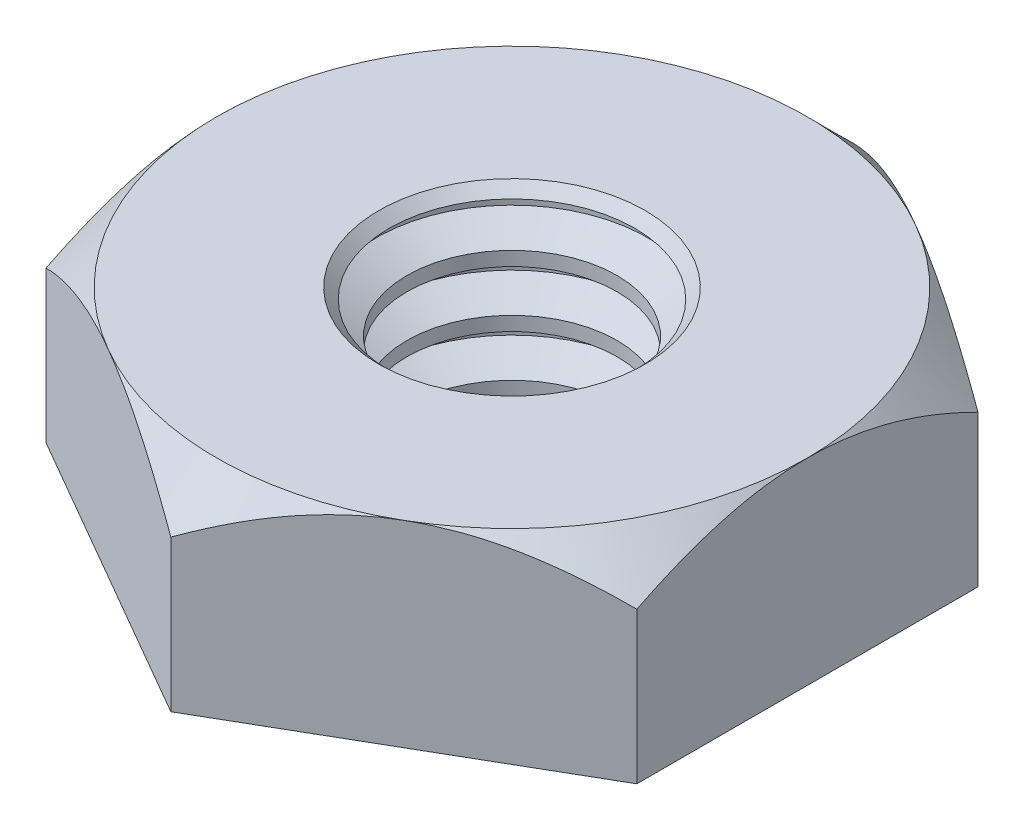
ISO-10303-21;
HEADER;
FILE_DESCRIPTION(('STEP AP214'),'2;1');
FILE_NAME('part.step','',(''),(''),'','','');
FILE_SCHEMA(('AUTOMOTIVE_DESIGN { 1 0 10303 214 1 1 1 1 }'));
ENDSEC;
DATA;
#1=APPLICATION_CONTEXT('core data for automotive mechanical design processes');
#2=APPLICATION_PROTOCOL_DEFINITION('international standard','automotive_design',2000,#1);
#3=PRODUCT_CONTEXT('',#1,'mechanical');
#4=PRODUCT('Part','Part','',(#3));
#5=PRODUCT_RELATED_PRODUCT_CATEGORY('part','',(#4));
#6=PRODUCT_DEFINITION_FORMATION('','',#4);
#7=PRODUCT_DEFINITION_CONTEXT('part definition',#1,'design');
#8=PRODUCT_DEFINITION('design','',#6,#7);
#9=PRODUCT_DEFINITION_SHAPE('','',#8);
#10=(LENGTH_UNIT() NAMED_UNIT(*) SI_UNIT(.MILLI.,.METRE.));
#11=(NAMED_UNIT(*) PLANE_ANGLE_UNIT() SI_UNIT($,.RADIAN.));
#12=(NAMED_UNIT(*) SI_UNIT($,.STERADIAN.) SOLID_ANGLE_UNIT());
#13=UNCERTAINTY_MEASURE_WITH_UNIT(LENGTH_MEASURE(1.E-05),#10,'distance_accuracy_value','');
#14=(GEOMETRIC_REPRESENTATION_CONTEXT(3) GLOBAL_UNCERTAINTY_ASSIGNED_CONTEXT((#13)) GLOBAL_UNIT_ASSIGNED_CONTEXT((#10,
#11,#12)) REPRESENTATION_CONTEXT('',''));
#15=CARTESIAN_POINT('',(0.,0.,0.));
#16=DIRECTION('',(0.,0.,1.));
#17=DIRECTION('',(1.,0.,0.));
#18=AXIS2_PLACEMENT_3D('',#15,#16,#17);
#19=CARTESIAN_POINT('',(0.,0.,-2.7496306570156));
#20=DIRECTION('',(0.,1.,0.));
#21=DIRECTION('',(0.,0.,1.));
#22=AXIS2_PLACEMENT_3D('',#19,#20,#21);
#23=PLANE('',#22);
#24=DIRECTION('',(-0.866025403784439,0.,-0.5));
#25=VECTOR('',#24,1.);
#26=CARTESIAN_POINT('',(2.38125,0.,-1.37481532850781));
#27=LINE('',#26,#25);
#28=CARTESIAN_POINT('',(2.38125,0.,-1.37481532850781));
#29=VERTEX_POINT('',#28);
#30=CARTESIAN_POINT('',(0.,0.,-2.7496306570156));
#31=VERTEX_POINT('',#30);
#32=EDGE_CURVE('E239',#29,#31,#27,.T.);
#33=ORIENTED_EDGE('',*,*,#32,.F.);
#34=DIRECTION('',(0.,0.,-1.));
#35=VECTOR('',#34,1.);
#36=CARTESIAN_POINT('',(2.38125,0.,1.37481532850779));
#37=LINE('',#36,#35);
#38=CARTESIAN_POINT('',(2.38125,0.,1.37481532850779));
#39=VERTEX_POINT('',#38);
#40=EDGE_CURVE('E328',#39,#29,#37,.T.);
#41=ORIENTED_EDGE('',*,*,#40,.F.);
#42=DIRECTION('',(0.866025403784439,0.,-0.5));
#43=VECTOR('',#42,1.);
#44=CARTESIAN_POINT('',(0.,0.,2.74963065701559));
#45=LINE('',#44,#43);
#46=CARTESIAN_POINT('',(0.,0.,2.74963065701559));
#47=VERTEX_POINT('',#46);
#48=EDGE_CURVE('E327',#47,#39,#45,.T.);
#49=ORIENTED_EDGE('',*,*,#48,.F.);
#50=DIRECTION('',(0.866025403784439,0.,0.5));
#51=VECTOR('',#50,1.);
#52=CARTESIAN_POINT('',(-2.38125,0.,1.37481532850779));
#53=LINE('',#52,#51);
#54=CARTESIAN_POINT('',(-2.38125,0.,1.37481532850779));
#55=VERTEX_POINT('',#54);
#56=EDGE_CURVE('E126',#55,#47,#53,.T.);
#57=ORIENTED_EDGE('',*,*,#56,.F.);
#58=DIRECTION('',(0.,0.,1.));
#59=VECTOR('',#58,1.);
#60=CARTESIAN_POINT('',(-2.38125,0.,-1.3748153285078));
#61=LINE('',#60,#59);
#62=CARTESIAN_POINT('',(-2.38125,0.,-1.3748153285078));
#63=VERTEX_POINT('',#62);
#64=EDGE_CURVE('E333',#63,#55,#61,.T.);
#65=ORIENTED_EDGE('',*,*,#64,.F.);
#66=DIRECTION('',(-0.866025403784438,0.,0.500000000000001));
#67=VECTOR('',#66,1.);
#68=CARTESIAN_POINT('',(0.,0.,-2.7496306570156));
#69=LINE('',#68,#67);
#70=EDGE_CURVE('E336',#31,#63,#69,.T.);
#71=ORIENTED_EDGE('',*,*,#70,.F.);
#72=EDGE_LOOP('',(#33,#41,#49,#57,#65,#71));
#73=FACE_BOUND('',#72,.T.);
#74=CARTESIAN_POINT('',(0.,0.,0.));
#75=DIRECTION('',(0.,1.,0.));
#76=DIRECTION('',(0.,0.,1.));
#77=AXIS2_PLACEMENT_3D('',#74,#75,#76);
#78=CIRCLE('',#77,1.04309945255329);
#79=CARTESIAN_POINT('',(0.,0.,1.04309945255329));
#80=VERTEX_POINT('',#79);
#81=EDGE_CURVE('E143',#80,#80,#78,.F.);
#82=ORIENTED_EDGE('',*,*,#81,.F.);
#83=EDGE_LOOP('',(#82));
#84=FACE_BOUND('',#83,.T.);
#85=ADVANCED_FACE('F32',(#73,#84),#23,.F.);
#86=CARTESIAN_POINT('',(0.,1.5875,-2.7496306570156));
#87=DIRECTION('',(0.,1.,0.));
#88=DIRECTION('',(0.,0.,1.));
#89=AXIS2_PLACEMENT_3D('',#86,#87,#88);
#90=PLANE('',#89);
#91=CARTESIAN_POINT('',(0.,1.5875,0.));
#92=DIRECTION('',(0.,1.,0.));
#93=DIRECTION('',(0.,0.,1.));
#94=AXIS2_PLACEMENT_3D('',#91,#92,#93);
#95=CIRCLE('',#94,1.07348297705218);
#96=CARTESIAN_POINT('',(0.,1.5875,1.07348297705218));
#97=VERTEX_POINT('',#96);
#98=EDGE_CURVE('E11',#97,#97,#95,.F.);
#99=ORIENTED_EDGE('',*,*,#98,.T.);
#100=EDGE_LOOP('',(#99));
#101=FACE_BOUND('',#100,.T.);
#102=CARTESIAN_POINT('',(0.,1.5875,0.));
#103=DIRECTION('',(0.,1.,0.));
#104=DIRECTION('',(0.,0.,1.));
#105=AXIS2_PLACEMENT_3D('',#102,#103,#104);
#106=CIRCLE('',#105,2.38125);
#107=CARTESIAN_POINT('',(-1.190625,1.5875,2.06222299276169));
#108=VERTEX_POINT('',#107);
#109=CARTESIAN_POINT('',(1.190625,1.5875,2.06222299276169));
#110=VERTEX_POINT('',#109);
#111=EDGE_CURVE('E108',#108,#110,#106,.T.);
#112=ORIENTED_EDGE('',*,*,#111,.T.);
#113=CARTESIAN_POINT('',(0.,1.5875,0.));
#114=DIRECTION('',(0.,1.,0.));
#115=DIRECTION('',(0.,0.,1.));
#116=AXIS2_PLACEMENT_3D('',#113,#114,#115);
#117=CIRCLE('',#116,2.38125);
#118=CARTESIAN_POINT('',(2.38125,1.5875,0.));
#119=VERTEX_POINT('',#118);
#120=EDGE_CURVE('E48',#110,#119,#117,.T.);
#121=ORIENTED_EDGE('',*,*,#120,.T.);
#122=CARTESIAN_POINT('',(1.190625,1.5875,-2.06222299276169));
#123=VERTEX_POINT('',#122);
#124=EDGE_CURVE('E142',#119,#123,#106,.T.);
#125=ORIENTED_EDGE('',*,*,#124,.T.);
#126=CARTESIAN_POINT('',(-1.190625,1.5875,-2.06222299276169));
#127=VERTEX_POINT('',#126);
#128=EDGE_CURVE('E150',#123,#127,#106,.T.);
#129=ORIENTED_EDGE('',*,*,#128,.T.);
#130=CARTESIAN_POINT('',(-2.38125,1.5875,0.));
#131=VERTEX_POINT('',#130);
#132=EDGE_CURVE('E153',#127,#131,#106,.T.);
#133=ORIENTED_EDGE('',*,*,#132,.T.);
#134=EDGE_CURVE('E141',#131,#108,#106,.T.);
#135=ORIENTED_EDGE('',*,*,#134,.T.);
#136=EDGE_LOOP('',(#112,#121,#125,#129,#133,#135));
#137=FACE_BOUND('',#136,.T.);
#138=ADVANCED_FACE('F160',(#101,#137),#90,.T.);
#139=CARTESIAN_POINT('',(2.38125,1.5875,-1.37481532850781));
#140=DIRECTION('',(-0.5,0.,0.866025403784439));
#141=DIRECTION('',(0.866025403784439,0.,0.5));
#142=AXIS2_PLACEMENT_3D('',#139,#140,#141);
#143=PLANE('',#142);
#144=CARTESIAN_POINT('',(2.38145,1.21900386565717,-1.37469985845397));
#145=CARTESIAN_POINT('',(2.29959321762095,1.26622444627487,-1.42195989379551));
#146=CARTESIAN_POINT('',(2.21636766622824,1.31067176769151,-1.47001018829555));
#147=CARTESIAN_POINT('',(2.04666151916196,1.39205388599882,-1.5679900779874));
#148=CARTESIAN_POINT('',(1.96016478264689,1.42894339988927,-1.61792899209839));
#149=CARTESIAN_POINT('',(1.78574822599095,1.4921359298185,-1.71862843803483));
#150=CARTESIAN_POINT('',(1.69787282881932,1.51859778425492,-1.76936332224702));
#151=CARTESIAN_POINT('',(1.52018740592912,1.55936782736834,-1.87195004898375));
#152=CARTESIAN_POINT('',(1.43038280881412,1.57370645145385,-1.92379875730256));
#153=CARTESIAN_POINT('',(1.27561039686965,1.58664355821429,-2.01315665100182));
#154=CARTESIAN_POINT('',(1.21084255103038,1.58855873833122,-2.05055038423196));
#155=CARTESIAN_POINT('',(1.08141272066442,1.58533272021672,-2.12527673163492));
#156=CARTESIAN_POINT('',(1.01675078120663,1.58018904812731,-2.16260931978719));
#157=CARTESIAN_POINT('',(0.888037451422591,1.56313803211276,-2.2369219953863));
#158=CARTESIAN_POINT('',(0.823986825765133,1.55122312163506,-2.2739016413514));
#159=CARTESIAN_POINT('',(0.696993161094712,1.52128367063236,-2.34722146783424));
#160=CARTESIAN_POINT('',(0.63405003756416,1.50325959846594,-2.38356169714824));
#161=CARTESIAN_POINT('',(0.472823849267805,1.44975053543199,-2.47664568036156));
#162=CARTESIAN_POINT('',(0.37554050871215,1.41023192211222,-2.53281224321903));
#163=CARTESIAN_POINT('',(0.232493937374424,1.3435189994336,-2.61540021968752));
#164=CARTESIAN_POINT('',(0.185353711056031,1.32007913387306,-2.64261664204211));
#165=CARTESIAN_POINT('',(0.0919464736333594,1.27106266632487,-2.69654533571235));
#166=CARTESIAN_POINT('',(0.0456789475031774,1.24548737621755,-2.72325790437834));
#167=CARTESIAN_POINT('',(-0.000199999999999734,1.21900386565717,-2.74974612706944));
#168=B_SPLINE_CURVE_WITH_KNOTS('',3,(#144,#145,#146,#147,#148,#149,#150,#151,#152,#153,#154,
#155,#156,#157,#158,#159,#160,#161,#162,#163,#164,#165,#166,#167),.UNSPECIFIED.,.F.,.F.,(4,2,2,
2,2,2,2,2,2,2,2,4),(0.,0.317196610611949,0.636241461041219,0.950218950629223,1.26340583824126,
1.48752413747844,1.71172100167748,1.93616888974083,2.16059957440838,2.51709639744763,
2.69486147369099,2.87251813383153),.UNSPECIFIED.);
#169=CARTESIAN_POINT('',(2.38125,1.2191193429844,-1.37481532850782));
#170=VERTEX_POINT('',#169);
#171=EDGE_CURVE('E338',#170,#123,#168,.T.);
#172=ORIENTED_EDGE('',*,*,#171,.F.);
#173=DIRECTION('',(0.,-1.,0.));
#174=VECTOR('',#173,1.);
#175=CARTESIAN_POINT('',(2.38125,1.5875,-1.37481532850781));
#176=LINE('',#175,#174);
#177=EDGE_CURVE('E133',#170,#29,#176,.T.);
#178=ORIENTED_EDGE('',*,*,#177,.T.);
#179=ORIENTED_EDGE('',*,*,#32,.T.);
#180=DIRECTION('',(0.,-1.,0.));
#181=VECTOR('',#180,1.);
#182=CARTESIAN_POINT('',(0.,1.5875,-2.7496306570156));
#183=LINE('',#182,#181);
#184=CARTESIAN_POINT('',(0.,1.2191193429844,-2.7496306570156));
#185=VERTEX_POINT('',#184);
#186=EDGE_CURVE('E138',#185,#31,#183,.T.);
#187=ORIENTED_EDGE('',*,*,#186,.F.);
#188=EDGE_CURVE('E211',#123,#185,#168,.T.);
#189=ORIENTED_EDGE('',*,*,#188,.F.);
#190=EDGE_LOOP('',(#172,#178,#179,#187,#189));
#191=FACE_BOUND('',#190,.T.);
#192=ADVANCED_FACE('F34',(#191),#143,.F.);
#193=CARTESIAN_POINT('',(0.,1.5875,-2.7496306570156));
#194=DIRECTION('',(0.500000000000001,0.,0.866025403784438));
#195=DIRECTION('',(0.866025403784438,0.,-0.500000000000001));
#196=AXIS2_PLACEMENT_3D('',#193,#194,#195);
#197=PLANE('',#196);
#198=CARTESIAN_POINT('',(0.000200000000000166,1.21900386565717,-2.74974612706944));
#199=CARTESIAN_POINT('',(-0.0816567823790508,1.26622444627487,-2.7024860917279));
#200=CARTESIAN_POINT('',(-0.164882333771762,1.31067176769151,-2.65443579722786));
#201=CARTESIAN_POINT('',(-0.334588480838043,1.39205388599882,-2.55645590753601));
#202=CARTESIAN_POINT('',(-0.421085217353107,1.42894339988927,-2.50651699342501));
#203=CARTESIAN_POINT('',(-0.595501774009049,1.49213592981849,-2.40581754748858));
#204=CARTESIAN_POINT('',(-0.683377171180682,1.51859778425492,-2.35508266327639));
#205=CARTESIAN_POINT('',(-0.861062594070885,1.55936782736834,-2.25249593653966));
#206=CARTESIAN_POINT('',(-0.950867191185882,1.57370645145385,-2.20064722822085));
#207=CARTESIAN_POINT('',(-1.10563960313035,1.58664355821429,-2.11128933452158));
#208=CARTESIAN_POINT('',(-1.17040744896963,1.58855873833122,-2.07389560129144));
#209=CARTESIAN_POINT('',(-1.29983727933559,1.58533272021672,-1.99916925388849));
#210=CARTESIAN_POINT('',(-1.36449921879337,1.58018904812731,-1.96183666573621));
#211=CARTESIAN_POINT('',(-1.49321254857742,1.56313803211276,-1.8875239901371));
#212=CARTESIAN_POINT('',(-1.55726317423487,1.55122312163507,-1.85054434417201));
#213=CARTESIAN_POINT('',(-1.68425683890529,1.52128367063237,-1.77722451768916));
#214=CARTESIAN_POINT('',(-1.74719996243585,1.50325959846595,-1.74088428837516));
#215=CARTESIAN_POINT('',(-1.9084261507322,1.44975053543199,-1.64780030516184));
#216=CARTESIAN_POINT('',(-2.00570949128785,1.41023192211222,-1.59163374230437));
#217=CARTESIAN_POINT('',(-2.14875606262558,1.3435189994336,-1.50904576583588));
#218=CARTESIAN_POINT('',(-2.19589628894397,1.32007913387307,-1.4818293434813));
#219=CARTESIAN_POINT('',(-2.28930352636664,1.27106266632487,-1.42790064981106));
#220=CARTESIAN_POINT('',(-2.33557105249682,1.24548737621755,-1.40118808114506));
#221=CARTESIAN_POINT('',(-2.38145,1.21900386565717,-1.37469985845397));
#222=B_SPLINE_CURVE_WITH_KNOTS('',3,(#198,#199,#200,#201,#202,#203,#204,#205,#206,#207,#208,
#209,#210,#211,#212,#213,#214,#215,#216,#217,#218,#219,#220,#221),.UNSPECIFIED.,.F.,.F.,(4,2,2,
2,2,2,2,2,2,2,2,4),(0.,0.317196610611952,0.636241461041225,0.950218950629232,1.26340583824127,
1.48752413747846,1.71172100167749,1.93616888974084,2.16059957440839,2.51709639744764,
2.694861473691,2.87251813383154),.UNSPECIFIED.);
#223=EDGE_CURVE('E210',#185,#127,#222,.T.);
#224=ORIENTED_EDGE('',*,*,#223,.F.);
#225=ORIENTED_EDGE('',*,*,#186,.T.);
#226=ORIENTED_EDGE('',*,*,#70,.T.);
#227=DIRECTION('',(0.,-1.,0.));
#228=VECTOR('',#227,1.);
#229=CARTESIAN_POINT('',(-2.38125,1.5875,-1.3748153285078));
#230=LINE('',#229,#228);
#231=CARTESIAN_POINT('',(-2.38125,1.2191193429844,-1.37481532850781));
#232=VERTEX_POINT('',#231);
#233=EDGE_CURVE('E131',#232,#63,#230,.T.);
#234=ORIENTED_EDGE('',*,*,#233,.F.);
#235=EDGE_CURVE('E206',#127,#232,#222,.T.);
#236=ORIENTED_EDGE('',*,*,#235,.F.);
#237=EDGE_LOOP('',(#224,#225,#226,#234,#236));
#238=FACE_BOUND('',#237,.T.);
#239=ADVANCED_FACE('F216',(#238),#197,.F.);
#240=CARTESIAN_POINT('',(-2.38125,1.5875,-1.3748153285078));
#241=DIRECTION('',(1.,0.,0.));
#242=DIRECTION('',(0.,0.,-1.));
#243=AXIS2_PLACEMENT_3D('',#240,#241,#242);
#244=PLANE('',#243);
#245=CARTESIAN_POINT('',(-2.38125,0.240179588906181,-2.86912630394419));
#246=CARTESIAN_POINT('',(-2.38125,0.293506689126681,-2.79980955592461));
#247=CARTESIAN_POINT('',(-2.38125,0.346355938633444,-2.7301193164531));
#248=CARTESIAN_POINT('',(-2.38125,0.450880424075711,-2.58983919614982));
#249=CARTESIAN_POINT('',(-2.38125,0.502555379296196,-2.51924910637501));
#250=CARTESIAN_POINT('',(-2.38125,0.604880705975389,-2.37650077502422));
#251=CARTESIAN_POINT('',(-2.38125,0.655520097364171,-2.30433463685783));
#252=CARTESIAN_POINT('',(-2.38125,0.755036614291812,-2.15880130547659));
#253=CARTESIAN_POINT('',(-2.38125,0.803913861173311,-2.08543419546942));
#254=CARTESIAN_POINT('',(-2.38125,0.902542961805656,-1.93258845780627));
#255=CARTESIAN_POINT('',(-2.38125,0.952152910200805,-1.85301779850509));
#256=CARTESIAN_POINT('',(-2.38125,1.04827866709485,-1.69203159559179));
#257=CARTESIAN_POINT('',(-2.38125,1.09479487864361,-1.61061629415846));
#258=CARTESIAN_POINT('',(-2.38125,1.18376557525143,-1.44588343133112));
#259=CARTESIAN_POINT('',(-2.38125,1.22623141970181,-1.36257205340724));
#260=CARTESIAN_POINT('',(-2.38125,1.30614212570996,-1.19359416640859));
#261=CARTESIAN_POINT('',(-2.38125,1.34358935588907,-1.10792879151245));
#262=CARTESIAN_POINT('',(-2.38125,1.40872452306872,-0.942635039086768));
#263=CARTESIAN_POINT('',(-2.38125,1.4370108001417,-0.86324486347623));
#264=CARTESIAN_POINT('',(-2.38125,1.48722865765993,-0.702441892782966));
#265=CARTESIAN_POINT('',(-2.38125,1.50915983334739,-0.621028969229365));
#266=CARTESIAN_POINT('',(-2.38125,1.54511481952273,-0.458084644425686));
#267=CARTESIAN_POINT('',(-2.38125,1.55928224783569,-0.376585475438002));
#268=CARTESIAN_POINT('',(-2.38125,1.57941416514849,-0.212574622282762));
#269=CARTESIAN_POINT('',(-2.38125,1.5853803560254,-0.1300631517693));
#270=CARTESIAN_POINT('',(-2.38125,1.58860164225672,0.031522259858205));
#271=CARTESIAN_POINT('',(-2.38125,1.58622590278112,0.110588903174689));
#272=CARTESIAN_POINT('',(-2.38125,1.5737417806567,0.268104622589961));
#273=CARTESIAN_POINT('',(-2.38125,1.56363269564102,0.346553641940321));
#274=CARTESIAN_POINT('',(-2.38125,1.53608239112472,0.503598587723649));
#275=CARTESIAN_POINT('',(-2.38125,1.51851172190116,0.582171453187212));
#276=CARTESIAN_POINT('',(-2.38125,1.47701024838173,0.737578750449081));
#277=CARTESIAN_POINT('',(-2.38125,1.45307980531335,0.814413280713858));
#278=CARTESIAN_POINT('',(-2.38125,1.37028997046201,1.05086897592276));
#279=CARTESIAN_POINT('',(-2.38125,1.30223450438981,1.20728049738153));
#280=CARTESIAN_POINT('',(-2.38125,1.18870821735986,1.43619844948697));
#281=CARTESIAN_POINT('',(-2.38125,1.14887086566416,1.51169480576284));
#282=CARTESIAN_POINT('',(-2.38125,1.0661066438325,1.6609787360797));
#283=CARTESIAN_POINT('',(-2.38125,1.02318031702828,1.73476660762932));
#284=CARTESIAN_POINT('',(-2.38125,0.937038433864163,1.87722638325708));
#285=CARTESIAN_POINT('',(-2.38125,0.893941790031278,1.94597101003489));
#286=CARTESIAN_POINT('',(-2.38125,0.805912978151154,2.08228069367819));
#287=CARTESIAN_POINT('',(-2.38125,0.760980672486613,2.14984566156212));
#288=CARTESIAN_POINT('',(-2.38125,0.669974823916356,2.2834054266231));
#289=CARTESIAN_POINT('',(-2.38125,0.62391334034527,2.34940847508033));
#290=CARTESIAN_POINT('',(-2.38125,0.53055562575305,2.48050909903297));
#291=CARTESIAN_POINT('',(-2.38125,0.483259738608898,2.54560691911997));
#292=CARTESIAN_POINT('',(-2.38125,0.435458445142948,2.61032519987917));
#293=B_SPLINE_CURVE_WITH_KNOTS('',3,(#245,#246,#247,#248,#249,#250,#251,#252,#253,#254,#255,
#256,#257,#258,#259,#260,#261,#262,#263,#264,#265,#266,#267,#268,#269,#270,#271,#272,#273,#274,
#275,#276,#277,#278,#279,#280,#281,#282,#283,#284,#285,#286,#287,#288,#289,#290,#291,#292),
.UNSPECIFIED.,.F.,.F.,(4,2,2,2,2,2,2,2,2,2,2,2,2,2,2,2,2,2,2,2,2,2,2,4),(0.,0.262373486076588,
0.524809046422166,0.789269246638219,1.05371120100018,1.33496294182564,1.61617796930576,
1.89657958024649,2.17684838122958,2.42946682102386,2.68210134660699,2.92988953986813,
3.17762630567771,3.41454048769348,3.65147618955809,3.89270212574338,4.13391436351259,
4.64406226241705,4.90012722407799,5.15614725506489,5.39952730752342,5.64292563948722,
5.88436975409123,6.12574731099199),.UNSPECIFIED.);
#294=EDGE_CURVE('E165',#232,#131,#293,.T.);
#295=ORIENTED_EDGE('',*,*,#294,.F.);
#296=ORIENTED_EDGE('',*,*,#233,.T.);
#297=ORIENTED_EDGE('',*,*,#64,.T.);
#298=DIRECTION('',(0.,-1.,0.));
#299=VECTOR('',#298,1.);
#300=CARTESIAN_POINT('',(-2.38125,1.5875,1.37481532850779));
#301=LINE('',#300,#299);
#302=CARTESIAN_POINT('',(-2.38125000000002,1.2191193429844,1.37481532850778));
#303=VERTEX_POINT('',#302);
#304=EDGE_CURVE('E128',#303,#55,#301,.T.);
#305=ORIENTED_EDGE('',*,*,#304,.F.);
#306=EDGE_CURVE('E163',#131,#303,#293,.T.);
#307=ORIENTED_EDGE('',*,*,#306,.F.);
#308=EDGE_LOOP('',(#295,#296,#297,#305,#307));
#309=FACE_BOUND('',#308,.T.);
#310=ADVANCED_FACE('F219',(#309),#244,.F.);
#311=CARTESIAN_POINT('',(-2.38125,1.5875,1.37481532850779));
#312=DIRECTION('',(0.5,0.,-0.866025403784439));
#313=DIRECTION('',(-0.866025403784439,0.,-0.5));
#314=AXIS2_PLACEMENT_3D('',#311,#312,#313);
#315=PLANE('',#314);
#316=CARTESIAN_POINT('',(-2.38145,1.21900386565718,1.37469985845395));
#317=CARTESIAN_POINT('',(-2.29959321762095,1.26622444627488,1.4219598937955));
#318=CARTESIAN_POINT('',(-2.21636766622824,1.31067176769152,1.47001018829553));
#319=CARTESIAN_POINT('',(-2.04666151916196,1.39205388599883,1.56799007798738));
#320=CARTESIAN_POINT('',(-1.9601647826469,1.42894339988927,1.61792899209838));
#321=CARTESIAN_POINT('',(-1.78574822599096,1.4921359298185,1.71862843803482));
#322=CARTESIAN_POINT('',(-1.69787282881932,1.51859778425493,1.769363322247));
#323=CARTESIAN_POINT('',(-1.52018740592912,1.55936782736835,1.87195004898373));
#324=CARTESIAN_POINT('',(-1.43038280881412,1.57370645145386,1.92379875730254));
#325=CARTESIAN_POINT('',(-1.27561039686965,1.5866435582143,2.01315665100181));
#326=CARTESIAN_POINT('',(-1.21084255103038,1.58855873833123,2.05055038423195));
#327=CARTESIAN_POINT('',(-1.08141272066442,1.58533272021673,2.1252767316349));
#328=CARTESIAN_POINT('',(-1.01675078120664,1.58018904812732,2.16260931978718));
#329=CARTESIAN_POINT('',(-0.888037451422593,1.56313803211277,2.23692199538629));
#330=CARTESIAN_POINT('',(-0.823986825765135,1.55122312163508,2.27390164135138));
#331=CARTESIAN_POINT('',(-0.696993161094714,1.52128367063238,2.34722146783423));
#332=CARTESIAN_POINT('',(-0.634050037564163,1.50325959846596,2.38356169714823));
#333=CARTESIAN_POINT('',(-0.472823849267807,1.449750535432,2.47664568036155));
#334=CARTESIAN_POINT('',(-0.375540508712152,1.41023192211223,2.53281224321902));
#335=CARTESIAN_POINT('',(-0.232493937374426,1.34351899943361,2.61540021968751));
#336=CARTESIAN_POINT('',(-0.185353711056032,1.32007913387308,2.64261664204209));
#337=CARTESIAN_POINT('',(-0.0919464736333602,1.27106266632488,2.69654533571233));
#338=CARTESIAN_POINT('',(-0.045678947503178,1.24548737621756,2.72325790437833));
#339=CARTESIAN_POINT('',(0.000199999999999358,1.21900386565718,2.74974612706943));
#340=B_SPLINE_CURVE_WITH_KNOTS('',3,(#316,#317,#318,#319,#320,#321,#322,#323,#324,#325,#326,
#327,#328,#329,#330,#331,#332,#333,#334,#335,#336,#337,#338,#339),.UNSPECIFIED.,.F.,.F.,(4,2,2,
2,2,2,2,2,2,2,2,4),(0.,0.317196610611951,0.636241461041222,0.950218950629227,1.26340583824127,
1.48752413747845,1.71172100167748,1.93616888974083,2.16059957440838,2.51709639744764,
2.69486147369099,2.87251813383154),.UNSPECIFIED.);
#341=EDGE_CURVE('E113',#303,#108,#340,.T.);
#342=ORIENTED_EDGE('',*,*,#341,.F.);
#343=ORIENTED_EDGE('',*,*,#304,.T.);
#344=ORIENTED_EDGE('',*,*,#56,.T.);
#345=DIRECTION('',(0.,-1.,0.));
#346=VECTOR('',#345,1.);
#347=CARTESIAN_POINT('',(0.,1.5875,2.74963065701559));
#348=LINE('',#347,#346);
#349=CARTESIAN_POINT('',(0.,1.2191193429844,2.7496306570156));
#350=VERTEX_POINT('',#349);
#351=EDGE_CURVE('E119',#350,#47,#348,.T.);
#352=ORIENTED_EDGE('',*,*,#351,.F.);
#353=EDGE_CURVE('E104',#108,#350,#340,.T.);
#354=ORIENTED_EDGE('',*,*,#353,.F.);
#355=EDGE_LOOP('',(#342,#343,#344,#352,#354));
#356=FACE_BOUND('',#355,.T.);
#357=ADVANCED_FACE('F124',(#356),#315,.F.);
#358=CARTESIAN_POINT('',(0.,1.5875,2.74963065701559));
#359=DIRECTION('',(-0.5,0.,-0.866025403784439));
#360=DIRECTION('',(-0.866025403784439,0.,0.5));
#361=AXIS2_PLACEMENT_3D('',#358,#359,#360);
#362=PLANE('',#361);
#363=CARTESIAN_POINT('',(-0.000200000000000334,1.21900386565718,2.74974612706943));
#364=CARTESIAN_POINT('',(0.0816567823790502,1.26622444627488,2.70248609172789));
#365=CARTESIAN_POINT('',(0.164882333771761,1.31067176769152,2.65443579722785));
#366=CARTESIAN_POINT('',(0.334588480838041,1.39205388599883,2.556455907536));
#367=CARTESIAN_POINT('',(0.421085217353105,1.42894339988928,2.506516993425));
#368=CARTESIAN_POINT('',(0.595501774009046,1.49213592981851,2.40581754748857));
#369=CARTESIAN_POINT('',(0.683377171180678,1.51859778425493,2.35508266327638));
#370=CARTESIAN_POINT('',(0.86106259407088,1.55936782736835,2.25249593653965));
#371=CARTESIAN_POINT('',(0.950867191185876,1.57370645145386,2.20064722822084));
#372=CARTESIAN_POINT('',(1.10563960313035,1.5866435582143,2.11128933452157));
#373=CARTESIAN_POINT('',(1.17040744896962,1.58855873833123,2.07389560129143));
#374=CARTESIAN_POINT('',(1.29983727933558,1.58533272021673,1.99916925388848));
#375=CARTESIAN_POINT('',(1.36449921879336,1.58018904812732,1.96183666573621));
#376=CARTESIAN_POINT('',(1.49321254857741,1.56313803211277,1.8875239901371));
#377=CARTESIAN_POINT('',(1.55726317423487,1.55122312163508,1.850544344172));
#378=CARTESIAN_POINT('',(1.68425683890529,1.52128367063238,1.77722451768916));
#379=CARTESIAN_POINT('',(1.74719996243584,1.50325959846596,1.74088428837516));
#380=CARTESIAN_POINT('',(1.90842615073219,1.449750535432,1.64780030516184));
#381=CARTESIAN_POINT('',(2.00570949128785,1.41023192211223,1.59163374230436));
#382=CARTESIAN_POINT('',(2.14875606262557,1.34351899943361,1.50904576583587));
#383=CARTESIAN_POINT('',(2.19589628894397,1.32007913387308,1.48182934348129));
#384=CARTESIAN_POINT('',(2.28930352636664,1.27106266632488,1.42790064981105));
#385=CARTESIAN_POINT('',(2.33557105249682,1.24548737621756,1.40118808114505));
#386=CARTESIAN_POINT('',(2.38145,1.21900386565718,1.37469985845396));
#387=B_SPLINE_CURVE_WITH_KNOTS('',3,(#363,#364,#365,#366,#367,#368,#369,#370,#371,#372,#373,
#374,#375,#376,#377,#378,#379,#380,#381,#382,#383,#384,#385,#386),.UNSPECIFIED.,.F.,.F.,(4,2,2,
2,2,2,2,2,2,2,2,4),(0.,0.31719661061195,0.636241461041222,0.950218950629226,1.26340583824126,
1.48752413747845,1.71172100167748,1.93616888974083,2.16059957440838,2.51709639744763,
2.69486147369099,2.87251813383153),.UNSPECIFIED.);
#388=EDGE_CURVE('E107',#350,#110,#387,.T.);
#389=ORIENTED_EDGE('',*,*,#388,.F.);
#390=ORIENTED_EDGE('',*,*,#351,.T.);
#391=ORIENTED_EDGE('',*,*,#48,.T.);
#392=DIRECTION('',(0.,-1.,0.));
#393=VECTOR('',#392,1.);
#394=CARTESIAN_POINT('',(2.38125,1.5875,1.37481532850779));
#395=LINE('',#394,#393);
#396=CARTESIAN_POINT('',(2.38125,1.2191193429844,1.37481532850782));
#397=VERTEX_POINT('',#396);
#398=EDGE_CURVE('E129',#397,#39,#395,.T.);
#399=ORIENTED_EDGE('',*,*,#398,.F.);
#400=EDGE_CURVE('E122',#110,#397,#387,.T.);
#401=ORIENTED_EDGE('',*,*,#400,.F.);
#402=EDGE_LOOP('',(#389,#390,#391,#399,#401));
#403=FACE_BOUND('',#402,.T.);
#404=ADVANCED_FACE('F117',(#403),#362,.F.);
#405=CARTESIAN_POINT('',(2.38125,1.5875,1.37481532850779));
#406=DIRECTION('',(-1.,0.,0.));
#407=DIRECTION('',(0.,0.,1.));
#408=AXIS2_PLACEMENT_3D('',#405,#406,#407);
#409=PLANE('',#408);
#410=CARTESIAN_POINT('',(2.38125,0.240179588906176,-2.8691263039442));
#411=CARTESIAN_POINT('',(2.38125,0.293506689126676,-2.79980955592462));
#412=CARTESIAN_POINT('',(2.38125,0.346355938633439,-2.73011931645311));
#413=CARTESIAN_POINT('',(2.38125,0.450880424075706,-2.58983919614982));
#414=CARTESIAN_POINT('',(2.38125,0.502555379296192,-2.51924910637502));
#415=CARTESIAN_POINT('',(2.38125,0.604880705975386,-2.37650077502423));
#416=CARTESIAN_POINT('',(2.38125,0.655520097364168,-2.30433463685784));
#417=CARTESIAN_POINT('',(2.38125,0.755036614291809,-2.1588013054766));
#418=CARTESIAN_POINT('',(2.38125,0.803913861173308,-2.08543419546942));
#419=CARTESIAN_POINT('',(2.38125,0.902542961805654,-1.93258845780627));
#420=CARTESIAN_POINT('',(2.38125,0.952152910200804,-1.8530177985051));
#421=CARTESIAN_POINT('',(2.38125,1.04827866709485,-1.69203159559179));
#422=CARTESIAN_POINT('',(2.38125,1.09479487864361,-1.61061629415846));
#423=CARTESIAN_POINT('',(2.38125,1.18376557525143,-1.44588343133113));
#424=CARTESIAN_POINT('',(2.38125,1.22623141970181,-1.36257205340725));
#425=CARTESIAN_POINT('',(2.38125,1.30614212570997,-1.19359416640859));
#426=CARTESIAN_POINT('',(2.38125,1.34358935588908,-1.10792879151245));
#427=CARTESIAN_POINT('',(2.38125,1.40872452306873,-0.942635039086772));
#428=CARTESIAN_POINT('',(2.38125,1.43701080014171,-0.863244863476234));
#429=CARTESIAN_POINT('',(2.38125,1.48722865765993,-0.70244189278297));
#430=CARTESIAN_POINT('',(2.38125,1.50915983334739,-0.621028969229369));
#431=CARTESIAN_POINT('',(2.38125,1.54511481952273,-0.45808464442569));
#432=CARTESIAN_POINT('',(2.38125,1.55928224783569,-0.376585475438006));
#433=CARTESIAN_POINT('',(2.38125,1.57941416514849,-0.212574622282766));
#434=CARTESIAN_POINT('',(2.38125,1.58538035602541,-0.130063151769303));
#435=CARTESIAN_POINT('',(2.38125,1.58860164225672,0.0315222598582019));
#436=CARTESIAN_POINT('',(2.38125,1.58622590278112,0.110588903174686));
#437=CARTESIAN_POINT('',(2.38125,1.5737417806567,0.268104622589958));
#438=CARTESIAN_POINT('',(2.38125,1.56363269564102,0.346553641940318));
#439=CARTESIAN_POINT('',(2.38125,1.53608239112472,0.503598587723646));
#440=CARTESIAN_POINT('',(2.38125,1.51851172190117,0.58217145318721));
#441=CARTESIAN_POINT('',(2.38125,1.47701024838173,0.737578750449078));
#442=CARTESIAN_POINT('',(2.38125,1.45307980531336,0.814413280713856));
#443=CARTESIAN_POINT('',(2.38125,1.37028997046202,1.05086897592276));
#444=CARTESIAN_POINT('',(2.38125,1.30223450438981,1.20728049738153));
#445=CARTESIAN_POINT('',(2.38125,1.18870821735987,1.43619844948697));
#446=CARTESIAN_POINT('',(2.38125,1.14887086566416,1.51169480576284));
#447=CARTESIAN_POINT('',(2.38125,1.06610664383251,1.66097873607969));
#448=CARTESIAN_POINT('',(2.38125,1.02318031702829,1.73476660762932));
#449=CARTESIAN_POINT('',(2.38125,0.93703843386417,1.87722638325707));
#450=CARTESIAN_POINT('',(2.38125,0.893941790031285,1.94597101003488));
#451=CARTESIAN_POINT('',(2.38125,0.805912978151162,2.08228069367818));
#452=CARTESIAN_POINT('',(2.38125,0.76098067248662,2.14984566156211));
#453=CARTESIAN_POINT('',(2.38125,0.669974823916364,2.28340542662309));
#454=CARTESIAN_POINT('',(2.38125,0.623913340345278,2.34940847508032));
#455=CARTESIAN_POINT('',(2.38125,0.530555625753058,2.48050909903296));
#456=CARTESIAN_POINT('',(2.38125,0.483259738608906,2.54560691911996));
#457=CARTESIAN_POINT('',(2.38125,0.435458445142958,2.61032519987917));
#458=B_SPLINE_CURVE_WITH_KNOTS('',3,(#410,#411,#412,#413,#414,#415,#416,#417,#418,#419,#420,
#421,#422,#423,#424,#425,#426,#427,#428,#429,#430,#431,#432,#433,#434,#435,#436,#437,#438,#439,
#440,#441,#442,#443,#444,#445,#446,#447,#448,#449,#450,#451,#452,#453,#454,#455,#456,#457),
.UNSPECIFIED.,.F.,.F.,(4,2,2,2,2,2,2,2,2,2,2,2,2,2,2,2,2,2,2,2,2,2,2,4),(0.,0.26237348607659,
0.524809046422169,0.789269246638222,1.05371120100018,1.33496294182565,1.61617796930576,
1.8965795802465,2.17684838122959,2.42946682102387,2.682101346607,2.92988953986814,
3.17762630567772,3.41454048769349,3.6514761895581,3.89270212574339,4.1339143635126,
4.64406226241706,4.900127224078,5.1561472550649,5.39952730752343,5.64292563948723,
5.88436975409124,6.125747310992),.UNSPECIFIED.);
#459=EDGE_CURVE('E319',#397,#119,#458,.F.);
#460=ORIENTED_EDGE('',*,*,#459,.F.);
#461=ORIENTED_EDGE('',*,*,#398,.T.);
#462=ORIENTED_EDGE('',*,*,#40,.T.);
#463=ORIENTED_EDGE('',*,*,#177,.F.);
#464=EDGE_CURVE('E196',#119,#170,#458,.F.);
#465=ORIENTED_EDGE('',*,*,#464,.F.);
#466=EDGE_LOOP('',(#460,#461,#462,#463,#465));
#467=FACE_BOUND('',#466,.T.);
#468=ADVANCED_FACE('F324',(#467),#409,.F.);
#469=CARTESIAN_POINT('',(0.,1.5875,0.));
#470=DIRECTION('',(0.,-1.,0.));
#471=DIRECTION('',(0.,0.,-1.));
#472=AXIS2_PLACEMENT_3D('',#469,#470,#471);
#473=CONICAL_SURFACE('',#472,2.38125,0.785398163397455);
#474=ORIENTED_EDGE('',*,*,#353,.T.);
#475=ORIENTED_EDGE('',*,*,#388,.T.);
#476=ORIENTED_EDGE('',*,*,#111,.F.);
#477=EDGE_LOOP('',(#474,#475,#476));
#478=FACE_BOUND('',#477,.T.);
#479=ADVANCED_FACE('F106',(#478),#473,.T.);
#480=ORIENTED_EDGE('',*,*,#306,.T.);
#481=ORIENTED_EDGE('',*,*,#341,.T.);
#482=ORIENTED_EDGE('',*,*,#134,.F.);
#483=EDGE_LOOP('',(#480,#481,#482));
#484=FACE_BOUND('',#483,.T.);
#485=ADVANCED_FACE('F162',(#484),#473,.T.);
#486=ORIENTED_EDGE('',*,*,#235,.T.);
#487=ORIENTED_EDGE('',*,*,#294,.T.);
#488=ORIENTED_EDGE('',*,*,#132,.F.);
#489=EDGE_LOOP('',(#486,#487,#488));
#490=FACE_BOUND('',#489,.T.);
#491=ADVANCED_FACE('F344',(#490),#473,.T.);
#492=ORIENTED_EDGE('',*,*,#188,.T.);
#493=ORIENTED_EDGE('',*,*,#223,.T.);
#494=ORIENTED_EDGE('',*,*,#128,.F.);
#495=EDGE_LOOP('',(#492,#493,#494));
#496=FACE_BOUND('',#495,.T.);
#497=ADVANCED_FACE('F189',(#496),#473,.T.);
#498=ORIENTED_EDGE('',*,*,#171,.T.);
#499=ORIENTED_EDGE('',*,*,#124,.F.);
#500=ORIENTED_EDGE('',*,*,#464,.T.);
#501=EDGE_LOOP('',(#498,#499,#500));
#502=FACE_BOUND('',#501,.T.);
#503=ADVANCED_FACE('F183',(#502),#473,.T.);
#504=ORIENTED_EDGE('',*,*,#400,.T.);
#505=ORIENTED_EDGE('',*,*,#459,.T.);
#506=ORIENTED_EDGE('',*,*,#120,.F.);
#507=EDGE_LOOP('',(#504,#505,#506));
#508=FACE_BOUND('',#507,.T.);
#509=ADVANCED_FACE('F188',(#508),#473,.T.);
#510=CARTESIAN_POINT('',(0.,1.44575892857143,0.));
#511=DIRECTION('',(0.,-1.,0.));
#512=DIRECTION('',(0.,0.,-1.));
#513=AXIS2_PLACEMENT_3D('',#510,#511,#512);
#514=CONICAL_SURFACE('',#513,1.0922,1.0471975511966);
#515=CARTESIAN_POINT('',(0.,1.50449066735603,0.));
#516=DIRECTION('',(0.,1.,0.));
#517=DIRECTION('',(0.,0.,1.));
#518=AXIS2_PLACEMENT_3D('',#515,#516,#517);
#519=CIRCLE('',#518,0.990473644408207);
#520=CARTESIAN_POINT('',(0.,1.50449066735603,0.990473644408207));
#521=VERTEX_POINT('',#520);
#522=EDGE_CURVE('E41',#521,#521,#519,.T.);
#523=ORIENTED_EDGE('',*,*,#522,.T.);
#524=EDGE_LOOP('',(#523));
#525=FACE_BOUND('',#524,.T.);
#526=CARTESIAN_POINT('',(0.,1.44575892857143,0.));
#527=DIRECTION('',(0.,1.,0.));
#528=DIRECTION('',(0.,0.,1.));
#529=AXIS2_PLACEMENT_3D('',#526,#527,#528);
#530=CIRCLE('',#529,1.0922);
#531=CARTESIAN_POINT('',(0.,1.44575892857143,1.0922));
#532=VERTEX_POINT('',#531);
#533=EDGE_CURVE('E308',#532,#532,#530,.T.);
#534=ORIENTED_EDGE('',*,*,#533,.F.);
#535=EDGE_LOOP('',(#534));
#536=FACE_BOUND('',#535,.T.);
#537=ADVANCED_FACE('F191',(#525,#536),#514,.F.);
#538=CARTESIAN_POINT('',(0.,1.66357854098429,0.));
#539=DIRECTION('',(0.,1.,0.));
#540=DIRECTION('',(0.,0.,1.));
#541=AXIS2_PLACEMENT_3D('',#538,#539,#540);
#542=CYLINDRICAL_SURFACE('',#541,1.0922);
#543=ORIENTED_EDGE('',*,*,#533,.T.);
#544=EDGE_LOOP('',(#543));
#545=FACE_BOUND('',#544,.T.);
#546=CARTESIAN_POINT('',(0.,1.3890625,0.));
#547=DIRECTION('',(0.,1.,0.));
#548=DIRECTION('',(0.,0.,1.));
#549=AXIS2_PLACEMENT_3D('',#546,#547,#548);
#550=CIRCLE('',#549,1.0922);
#551=CARTESIAN_POINT('',(0.,1.3890625,1.0922));
#552=VERTEX_POINT('',#551);
#553=EDGE_CURVE('E311',#552,#552,#550,.T.);
#554=ORIENTED_EDGE('',*,*,#553,.F.);
#555=EDGE_LOOP('',(#554));
#556=FACE_BOUND('',#555,.T.);
#557=ADVANCED_FACE('F298',(#545,#556),#542,.F.);
#558=CARTESIAN_POINT('',(0.,1.24732142857143,0.));
#559=DIRECTION('',(0.,1.,0.));
#560=DIRECTION('',(0.,0.,1.));
#561=AXIS2_PLACEMENT_3D('',#558,#559,#560);
#562=CONICAL_SURFACE('',#561,0.846697262766464,1.0471975511966);
#563=ORIENTED_EDGE('',*,*,#553,.T.);
#564=EDGE_LOOP('',(#563));
#565=FACE_BOUND('',#564,.T.);
#566=CARTESIAN_POINT('',(0.,1.24732142857143,0.));
#567=DIRECTION('',(0.,1.,0.));
#568=DIRECTION('',(0.,0.,1.));
#569=AXIS2_PLACEMENT_3D('',#566,#567,#568);
#570=CIRCLE('',#569,0.846697262766464);
#571=CARTESIAN_POINT('',(0.,1.24732142857143,0.846697262766464));
#572=VERTEX_POINT('',#571);
#573=EDGE_CURVE('E312',#572,#572,#570,.T.);
#574=ORIENTED_EDGE('',*,*,#573,.F.);
#575=EDGE_LOOP('',(#574));
#576=FACE_BOUND('',#575,.T.);
#577=ADVANCED_FACE('F295',(#565,#576),#562,.F.);
#578=CARTESIAN_POINT('',(0.,1.66357854098429,0.));
#579=DIRECTION('',(0.,1.,0.));
#580=DIRECTION('',(0.,0.,1.));
#581=AXIS2_PLACEMENT_3D('',#578,#579,#580);
#582=CYLINDRICAL_SURFACE('',#581,0.846697262766464);
#583=ORIENTED_EDGE('',*,*,#573,.T.);
#584=EDGE_LOOP('',(#583));
#585=FACE_BOUND('',#584,.T.);
#586=CARTESIAN_POINT('',(0.,1.13392857142857,0.));
#587=DIRECTION('',(0.,1.,0.));
#588=DIRECTION('',(0.,0.,1.));
#589=AXIS2_PLACEMENT_3D('',#586,#587,#588);
#590=CIRCLE('',#589,0.846697262766464);
#591=CARTESIAN_POINT('',(0.,1.13392857142857,0.846697262766464));
#592=VERTEX_POINT('',#591);
#593=EDGE_CURVE('E316',#592,#592,#590,.T.);
#594=ORIENTED_EDGE('',*,*,#593,.F.);
#595=EDGE_LOOP('',(#594));
#596=FACE_BOUND('',#595,.T.);
#597=ADVANCED_FACE('F291',(#585,#596),#582,.F.);
#598=CARTESIAN_POINT('',(0.,0.9921875,0.));
#599=DIRECTION('',(0.,-1.,0.));
#600=DIRECTION('',(0.,0.,-1.));
#601=AXIS2_PLACEMENT_3D('',#598,#599,#600);
#602=CONICAL_SURFACE('',#601,1.0922,1.0471975511966);
#603=ORIENTED_EDGE('',*,*,#593,.T.);
#604=EDGE_LOOP('',(#603));
#605=FACE_BOUND('',#604,.T.);
#606=CARTESIAN_POINT('',(0.,0.9921875,0.));
#607=DIRECTION('',(0.,1.,0.));
#608=DIRECTION('',(0.,0.,1.));
#609=AXIS2_PLACEMENT_3D('',#606,#607,#608);
#610=CIRCLE('',#609,1.0922);
#611=CARTESIAN_POINT('',(0.,0.9921875,1.0922));
#612=VERTEX_POINT('',#611);
#613=EDGE_CURVE('E535',#612,#612,#610,.T.);
#614=ORIENTED_EDGE('',*,*,#613,.F.);
#615=EDGE_LOOP('',(#614));
#616=FACE_BOUND('',#615,.T.);
#617=ADVANCED_FACE('F287',(#605,#616),#602,.F.);
#618=CARTESIAN_POINT('',(0.,1.21000711241286,0.));
#619=DIRECTION('',(0.,1.,0.));
#620=DIRECTION('',(0.,0.,1.));
#621=AXIS2_PLACEMENT_3D('',#618,#619,#620);
#622=CYLINDRICAL_SURFACE('',#621,1.0922);
#623=ORIENTED_EDGE('',*,*,#613,.T.);
#624=EDGE_LOOP('',(#623));
#625=FACE_BOUND('',#624,.T.);
#626=CARTESIAN_POINT('',(0.,0.935491071428571,0.));
#627=DIRECTION('',(0.,1.,0.));
#628=DIRECTION('',(0.,0.,1.));
#629=AXIS2_PLACEMENT_3D('',#626,#627,#628);
#630=CIRCLE('',#629,1.0922);
#631=CARTESIAN_POINT('',(0.,0.935491071428571,1.0922));
#632=VERTEX_POINT('',#631);
#633=EDGE_CURVE('E538',#632,#632,#630,.T.);
#634=ORIENTED_EDGE('',*,*,#633,.F.);
#635=EDGE_LOOP('',(#634));
#636=FACE_BOUND('',#635,.T.);
#637=ADVANCED_FACE('F283',(#625,#636),#622,.F.);
#638=CARTESIAN_POINT('',(0.,0.79375,0.));
#639=DIRECTION('',(0.,1.,0.));
#640=DIRECTION('',(0.,0.,1.));
#641=AXIS2_PLACEMENT_3D('',#638,#639,#640);
#642=CONICAL_SURFACE('',#641,0.846697262766464,1.0471975511966);
#643=ORIENTED_EDGE('',*,*,#633,.T.);
#644=EDGE_LOOP('',(#643));
#645=FACE_BOUND('',#644,.T.);
#646=CARTESIAN_POINT('',(0.,0.79375,0.));
#647=DIRECTION('',(0.,1.,0.));
#648=DIRECTION('',(0.,0.,1.));
#649=AXIS2_PLACEMENT_3D('',#646,#647,#648);
#650=CIRCLE('',#649,0.846697262766464);
#651=CARTESIAN_POINT('',(0.,0.79375,0.846697262766464));
#652=VERTEX_POINT('',#651);
#653=EDGE_CURVE('E541',#652,#652,#650,.T.);
#654=ORIENTED_EDGE('',*,*,#653,.F.);
#655=EDGE_LOOP('',(#654));
#656=FACE_BOUND('',#655,.T.);
#657=ADVANCED_FACE('F279',(#645,#656),#642,.F.);
#658=CARTESIAN_POINT('',(0.,1.21000711241286,0.));
#659=DIRECTION('',(0.,1.,0.));
#660=DIRECTION('',(0.,0.,1.));
#661=AXIS2_PLACEMENT_3D('',#658,#659,#660);
#662=CYLINDRICAL_SURFACE('',#661,0.846697262766464);
#663=ORIENTED_EDGE('',*,*,#653,.T.);
#664=EDGE_LOOP('',(#663));
#665=FACE_BOUND('',#664,.T.);
#666=CARTESIAN_POINT('',(0.,0.680357142857142,0.));
#667=DIRECTION('',(0.,1.,0.));
#668=DIRECTION('',(0.,0.,1.));
#669=AXIS2_PLACEMENT_3D('',#666,#667,#668);
#670=CIRCLE('',#669,0.846697262766464);
#671=CARTESIAN_POINT('',(0.,0.680357142857142,0.846697262766464));
#672=VERTEX_POINT('',#671);
#673=EDGE_CURVE('E544',#672,#672,#670,.T.);
#674=ORIENTED_EDGE('',*,*,#673,.F.);
#675=EDGE_LOOP('',(#674));
#676=FACE_BOUND('',#675,.T.);
#677=ADVANCED_FACE('F275',(#665,#676),#662,.F.);
#678=CARTESIAN_POINT('',(0.,0.538616071428571,0.));
#679=DIRECTION('',(0.,-1.,0.));
#680=DIRECTION('',(0.,0.,-1.));
#681=AXIS2_PLACEMENT_3D('',#678,#679,#680);
#682=CONICAL_SURFACE('',#681,1.0922,1.0471975511966);
#683=ORIENTED_EDGE('',*,*,#673,.T.);
#684=EDGE_LOOP('',(#683));
#685=FACE_BOUND('',#684,.T.);
#686=CARTESIAN_POINT('',(0.,0.538616071428571,0.));
#687=DIRECTION('',(0.,1.,0.));
#688=DIRECTION('',(0.,0.,1.));
#689=AXIS2_PLACEMENT_3D('',#686,#687,#688);
#690=CIRCLE('',#689,1.0922);
#691=CARTESIAN_POINT('',(0.,0.538616071428571,1.0922));
#692=VERTEX_POINT('',#691);
#693=EDGE_CURVE('E547',#692,#692,#690,.T.);
#694=ORIENTED_EDGE('',*,*,#693,.F.);
#695=EDGE_LOOP('',(#694));
#696=FACE_BOUND('',#695,.T.);
#697=ADVANCED_FACE('F271',(#685,#696),#682,.F.);
#698=CARTESIAN_POINT('',(0.,0.756435683841436,0.));
#699=DIRECTION('',(0.,1.,0.));
#700=DIRECTION('',(0.,0.,1.));
#701=AXIS2_PLACEMENT_3D('',#698,#699,#700);
#702=CYLINDRICAL_SURFACE('',#701,1.0922);
#703=ORIENTED_EDGE('',*,*,#693,.T.);
#704=EDGE_LOOP('',(#703));
#705=FACE_BOUND('',#704,.T.);
#706=CARTESIAN_POINT('',(0.,0.481919642857143,0.));
#707=DIRECTION('',(0.,1.,0.));
#708=DIRECTION('',(0.,0.,1.));
#709=AXIS2_PLACEMENT_3D('',#706,#707,#708);
#710=CIRCLE('',#709,1.0922);
#711=CARTESIAN_POINT('',(0.,0.481919642857143,1.0922));
#712=VERTEX_POINT('',#711);
#713=EDGE_CURVE('E550',#712,#712,#710,.T.);
#714=ORIENTED_EDGE('',*,*,#713,.F.);
#715=EDGE_LOOP('',(#714));
#716=FACE_BOUND('',#715,.T.);
#717=ADVANCED_FACE('F267',(#705,#716),#702,.F.);
#718=CARTESIAN_POINT('',(0.,0.340178571428571,0.));
#719=DIRECTION('',(0.,1.,0.));
#720=DIRECTION('',(0.,0.,1.));
#721=AXIS2_PLACEMENT_3D('',#718,#719,#720);
#722=CONICAL_SURFACE('',#721,0.846697262766464,1.0471975511966);
#723=ORIENTED_EDGE('',*,*,#713,.T.);
#724=EDGE_LOOP('',(#723));
#725=FACE_BOUND('',#724,.T.);
#726=CARTESIAN_POINT('',(0.,0.340178571428571,0.));
#727=DIRECTION('',(0.,1.,0.));
#728=DIRECTION('',(0.,0.,1.));
#729=AXIS2_PLACEMENT_3D('',#726,#727,#728);
#730=CIRCLE('',#729,0.846697262766464);
#731=CARTESIAN_POINT('',(0.,0.340178571428571,0.846697262766464));
#732=VERTEX_POINT('',#731);
#733=EDGE_CURVE('E145',#732,#732,#730,.T.);
#734=ORIENTED_EDGE('',*,*,#733,.F.);
#735=EDGE_LOOP('',(#734));
#736=FACE_BOUND('',#735,.T.);
#737=ADVANCED_FACE('F255',(#725,#736),#722,.F.);
#738=CARTESIAN_POINT('',(0.,0.756435683841436,0.));
#739=DIRECTION('',(0.,1.,0.));
#740=DIRECTION('',(0.,0.,1.));
#741=AXIS2_PLACEMENT_3D('',#738,#739,#740);
#742=CYLINDRICAL_SURFACE('',#741,0.846697262766464);
#743=ORIENTED_EDGE('',*,*,#733,.T.);
#744=EDGE_LOOP('',(#743));
#745=FACE_BOUND('',#744,.T.);
#746=CARTESIAN_POINT('',(0.,0.226785714285714,0.));
#747=DIRECTION('',(0.,1.,0.));
#748=DIRECTION('',(0.,0.,1.));
#749=AXIS2_PLACEMENT_3D('',#746,#747,#748);
#750=CIRCLE('',#749,0.846697262766464);
#751=CARTESIAN_POINT('',(0.,0.226785714285714,0.846697262766464));
#752=VERTEX_POINT('',#751);
#753=EDGE_CURVE('E146',#752,#752,#750,.T.);
#754=ORIENTED_EDGE('',*,*,#753,.F.);
#755=EDGE_LOOP('',(#754));
#756=FACE_BOUND('',#755,.T.);
#757=ADVANCED_FACE('F245',(#745,#756),#742,.F.);
#758=CARTESIAN_POINT('',(0.,-0.113392857142857,0.));
#759=DIRECTION('',(0.,1.,0.));
#760=DIRECTION('',(0.,0.,1.));
#761=AXIS2_PLACEMENT_3D('',#758,#759,#760);
#762=CONICAL_SURFACE('',#761,0.846697262766464,1.0471975511966);
#763=CARTESIAN_POINT('',(0.,0.0283482142857143,0.));
#764=DIRECTION('',(0.,1.,0.));
#765=DIRECTION('',(0.,0.,1.));
#766=AXIS2_PLACEMENT_3D('',#763,#764,#765);
#767=CIRCLE('',#766,1.0922);
#768=CARTESIAN_POINT('',(0.,0.0283482142857143,1.0922));
#769=VERTEX_POINT('',#768);
#770=EDGE_CURVE('E560',#769,#769,#767,.T.);
#771=ORIENTED_EDGE('',*,*,#770,.T.);
#772=EDGE_LOOP('',(#771));
#773=FACE_BOUND('',#772,.T.);
#774=ORIENTED_EDGE('',*,*,#81,.T.);
#775=EDGE_LOOP('',(#774));
#776=FACE_BOUND('',#775,.T.);
#777=ADVANCED_FACE('F242',(#773,#776),#762,.F.);
#778=CARTESIAN_POINT('',(0.,0.0850446428571428,0.));
#779=DIRECTION('',(0.,-1.,0.));
#780=DIRECTION('',(0.,0.,-1.));
#781=AXIS2_PLACEMENT_3D('',#778,#779,#780);
#782=CONICAL_SURFACE('',#781,1.0922,1.0471975511966);
#783=ORIENTED_EDGE('',*,*,#753,.T.);
#784=EDGE_LOOP('',(#783));
#785=FACE_BOUND('',#784,.T.);
#786=CARTESIAN_POINT('',(0.,0.0850446428571428,0.));
#787=DIRECTION('',(0.,1.,0.));
#788=DIRECTION('',(0.,0.,1.));
#789=AXIS2_PLACEMENT_3D('',#786,#787,#788);
#790=CIRCLE('',#789,1.0922);
#791=CARTESIAN_POINT('',(0.,0.0850446428571428,1.0922));
#792=VERTEX_POINT('',#791);
#793=EDGE_CURVE('E557',#792,#792,#790,.T.);
#794=ORIENTED_EDGE('',*,*,#793,.F.);
#795=EDGE_LOOP('',(#794));
#796=FACE_BOUND('',#795,.T.);
#797=ADVANCED_FACE('F244',(#785,#796),#782,.F.);
#798=CARTESIAN_POINT('',(0.,0.302864255270008,0.));
#799=DIRECTION('',(0.,1.,0.));
#800=DIRECTION('',(0.,0.,1.));
#801=AXIS2_PLACEMENT_3D('',#798,#799,#800);
#802=CYLINDRICAL_SURFACE('',#801,1.0922);
#803=ORIENTED_EDGE('',*,*,#793,.T.);
#804=EDGE_LOOP('',(#803));
#805=FACE_BOUND('',#804,.T.);
#806=ORIENTED_EDGE('',*,*,#770,.F.);
#807=EDGE_LOOP('',(#806));
#808=FACE_BOUND('',#807,.T.);
#809=ADVANCED_FACE('F252',(#805,#808),#802,.F.);
#810=CARTESIAN_POINT('',(0.,1.50449066735603,0.));
#811=DIRECTION('',(0.,1.,0.));
#812=DIRECTION('',(0.,0.,1.));
#813=AXIS2_PLACEMENT_3D('',#810,#811,#812);
#814=CONICAL_SURFACE('',#813,0.990473644408207,0.78539816339745);
#815=ORIENTED_EDGE('',*,*,#98,.F.);
#816=EDGE_LOOP('',(#815));
#817=FACE_BOUND('',#816,.T.);
#818=ORIENTED_EDGE('',*,*,#522,.F.);
#819=EDGE_LOOP('',(#818));
#820=FACE_BOUND('',#819,.T.);
#821=ADVANCED_FACE('F261',(#817,#820),#814,.F.);
#822=CLOSED_SHELL('',(#85,#138,#192,#239,#310,#357,#404,#468,#479,#485,#491,#497,#503,#509,#537,
#557,#577,#597,#617,#637,#657,#677,#697,#717,#737,#757,#777,#797,#809,#821));
#823=MANIFOLD_SOLID_BREP('B2',#822);
#824=ADVANCED_BREP_SHAPE_REPRESENTATION('',(#18,#823),#14);
#825=SHAPE_DEFINITION_REPRESENTATION(#9,#824);
ENDSEC;
END-ISO-10303-21;
